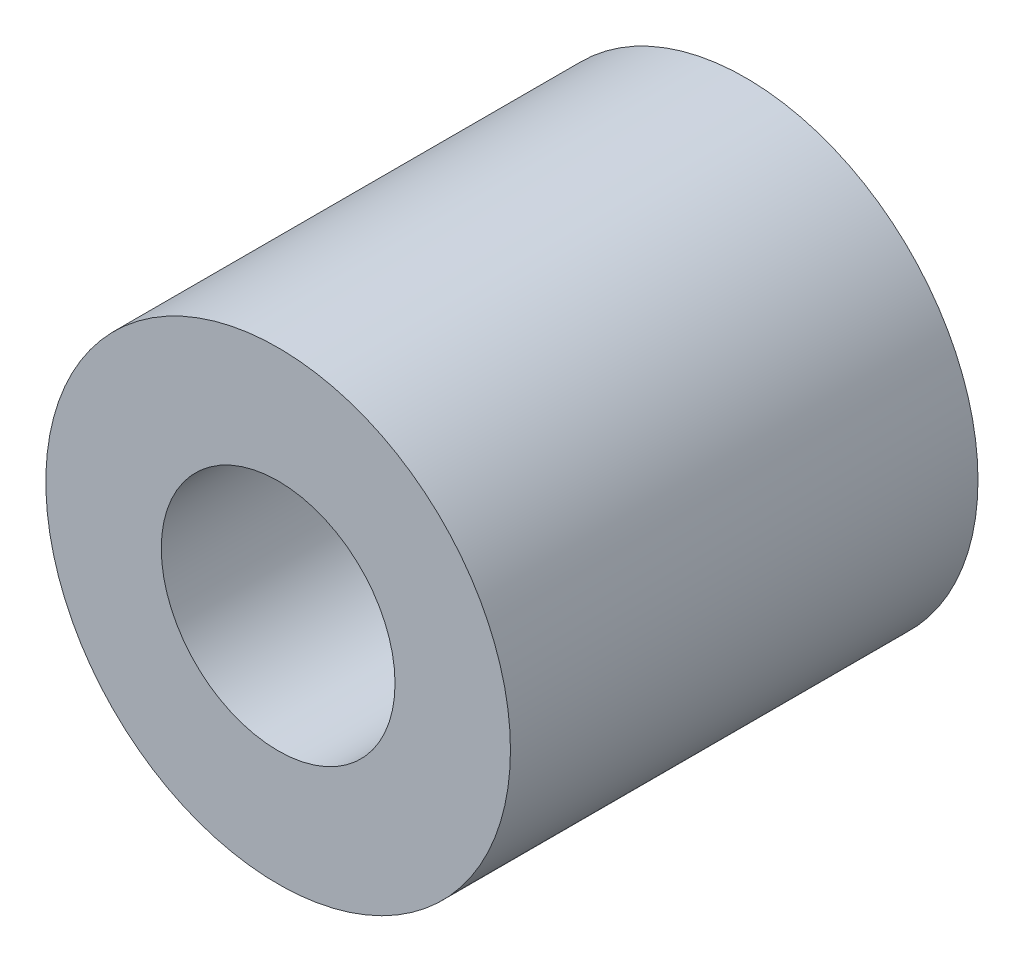
ISO-10303-21;
HEADER;
FILE_DESCRIPTION(('STEP AP214'),'2;1');
FILE_NAME('part.step','',(''),(''),'','','');
FILE_SCHEMA(('AUTOMOTIVE_DESIGN { 1 0 10303 214 1 1 1 1 }'));
ENDSEC;
DATA;
#1=APPLICATION_CONTEXT('core data for automotive mechanical design processes');
#2=APPLICATION_PROTOCOL_DEFINITION('international standard','automotive_design',2000,#1);
#3=PRODUCT_CONTEXT('',#1,'mechanical');
#4=PRODUCT('Part','Part','',(#3));
#5=PRODUCT_RELATED_PRODUCT_CATEGORY('part','',(#4));
#6=PRODUCT_DEFINITION_FORMATION('','',#4);
#7=PRODUCT_DEFINITION_CONTEXT('part definition',#1,'design');
#8=PRODUCT_DEFINITION('design','',#6,#7);
#9=PRODUCT_DEFINITION_SHAPE('','',#8);
#10=(LENGTH_UNIT() NAMED_UNIT(*) SI_UNIT(.MILLI.,.METRE.));
#11=(NAMED_UNIT(*) PLANE_ANGLE_UNIT() SI_UNIT($,.RADIAN.));
#12=(NAMED_UNIT(*) SI_UNIT($,.STERADIAN.) SOLID_ANGLE_UNIT());
#13=UNCERTAINTY_MEASURE_WITH_UNIT(LENGTH_MEASURE(1.E-05),#10,'distance_accuracy_value','');
#14=(GEOMETRIC_REPRESENTATION_CONTEXT(3) GLOBAL_UNCERTAINTY_ASSIGNED_CONTEXT((#13)) GLOBAL_UNIT_ASSIGNED_CONTEXT((#10,
#11,#12)) REPRESENTATION_CONTEXT('',''));
#15=CARTESIAN_POINT('',(0.,0.,0.));
#16=DIRECTION('',(0.,0.,1.));
#17=DIRECTION('',(1.,0.,0.));
#18=AXIS2_PLACEMENT_3D('',#15,#16,#17);
#19=CARTESIAN_POINT('',(0.,0.,16.));
#20=DIRECTION('',(0.,0.,0.999999999999994));
#21=DIRECTION('',(1.,0.,0.));
#22=AXIS2_PLACEMENT_3D('',#19,#20,#21);
#23=PLANE('',#22);
#24=CARTESIAN_POINT('',(0.,0.,16.));
#25=DIRECTION('',(0.,0.,0.999999999999994));
#26=DIRECTION('',(1.,0.,0.));
#27=AXIS2_PLACEMENT_3D('',#24,#25,#26);
#28=CIRCLE('',#27,7.95);
#29=CARTESIAN_POINT('',(7.95000000000007,0.,16.));
#30=VERTEX_POINT('',#29);
#31=EDGE_CURVE('E12',#30,#30,#28,.T.);
#32=ORIENTED_EDGE('',*,*,#31,.T.);
#33=EDGE_LOOP('',(#32));
#34=FACE_BOUND('',#33,.T.);
#35=CARTESIAN_POINT('',(0.,0.,16.));
#36=DIRECTION('',(0.,0.,0.999999999999994));
#37=DIRECTION('',(1.,0.,0.));
#38=AXIS2_PLACEMENT_3D('',#35,#36,#37);
#39=CIRCLE('',#38,4.);
#40=CARTESIAN_POINT('',(4.00000000000006,0.,16.));
#41=VERTEX_POINT('',#40);
#42=EDGE_CURVE('E73',#41,#41,#39,.T.);
#43=ORIENTED_EDGE('',*,*,#42,.F.);
#44=EDGE_LOOP('',(#43));
#45=FACE_BOUND('',#44,.T.);
#46=ADVANCED_FACE('F59',(#34,#45),#23,.T.);
#47=CARTESIAN_POINT('',(0.,0.,0.));
#48=DIRECTION('',(0.,0.,0.999999999999994));
#49=DIRECTION('',(1.,0.,0.));
#50=AXIS2_PLACEMENT_3D('',#47,#48,#49);
#51=PLANE('',#50);
#52=CARTESIAN_POINT('',(0.,0.,0.));
#53=DIRECTION('',(0.,0.,0.999999999999994));
#54=DIRECTION('',(1.,0.,0.));
#55=AXIS2_PLACEMENT_3D('',#52,#53,#54);
#56=CIRCLE('',#55,7.95);
#57=CARTESIAN_POINT('',(7.95000000000001,0.,0.));
#58=VERTEX_POINT('',#57);
#59=EDGE_CURVE('E63',#58,#58,#56,.T.);
#60=ORIENTED_EDGE('',*,*,#59,.F.);
#61=EDGE_LOOP('',(#60));
#62=FACE_BOUND('',#61,.T.);
#63=CARTESIAN_POINT('',(0.,0.,0.));
#64=DIRECTION('',(0.,0.,0.999999999999994));
#65=DIRECTION('',(1.,0.,0.));
#66=AXIS2_PLACEMENT_3D('',#63,#64,#65);
#67=CIRCLE('',#66,4.);
#68=CARTESIAN_POINT('',(4.,0.,0.));
#69=VERTEX_POINT('',#68);
#70=EDGE_CURVE('E75',#69,#69,#67,.T.);
#71=ORIENTED_EDGE('',*,*,#70,.T.);
#72=EDGE_LOOP('',(#71));
#73=FACE_BOUND('',#72,.T.);
#74=ADVANCED_FACE('F88',(#62,#73),#51,.F.);
#75=CARTESIAN_POINT('',(0.,0.,16.));
#76=DIRECTION('',(0.,0.,-0.999999999999994));
#77=DIRECTION('',(-1.,0.,0.));
#78=AXIS2_PLACEMENT_3D('',#75,#76,#77);
#79=CYLINDRICAL_SURFACE('',#78,7.95);
#80=ORIENTED_EDGE('',*,*,#31,.F.);
#81=EDGE_LOOP('',(#80));
#82=FACE_BOUND('',#81,.T.);
#83=ORIENTED_EDGE('',*,*,#59,.T.);
#84=EDGE_LOOP('',(#83));
#85=FACE_BOUND('',#84,.T.);
#86=ADVANCED_FACE('F61',(#82,#85),#79,.T.);
#87=CARTESIAN_POINT('',(0.,0.,16.));
#88=DIRECTION('',(0.,0.,-0.999999999999994));
#89=DIRECTION('',(-1.,0.,0.));
#90=AXIS2_PLACEMENT_3D('',#87,#88,#89);
#91=CYLINDRICAL_SURFACE('',#90,4.);
#92=ORIENTED_EDGE('',*,*,#42,.T.);
#93=EDGE_LOOP('',(#92));
#94=FACE_BOUND('',#93,.T.);
#95=ORIENTED_EDGE('',*,*,#70,.F.);
#96=EDGE_LOOP('',(#95));
#97=FACE_BOUND('',#96,.T.);
#98=ADVANCED_FACE('F84',(#94,#97),#91,.F.);
#99=CLOSED_SHELL('',(#46,#74,#86,#98));
#100=MANIFOLD_SOLID_BREP('B2',#99);
#101=ADVANCED_BREP_SHAPE_REPRESENTATION('',(#18,#100),#14);
#102=SHAPE_DEFINITION_REPRESENTATION(#9,#101);
ENDSEC;
END-ISO-10303-21;
